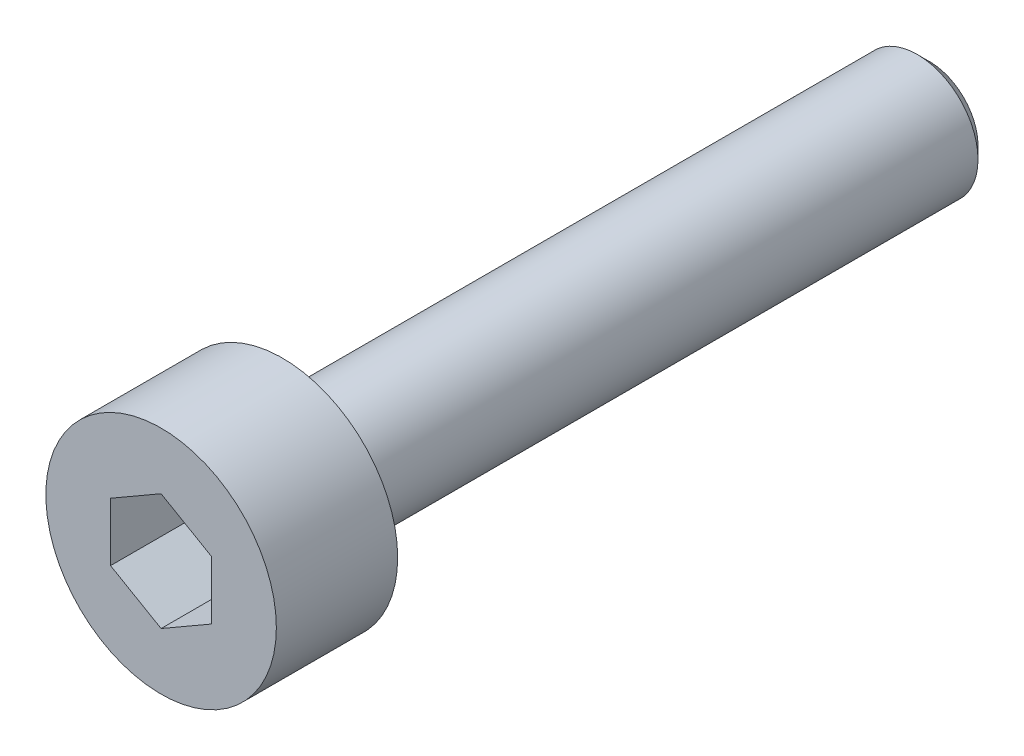
ISO-10303-21;
HEADER;
FILE_DESCRIPTION(('STEP AP214'),'2;1');
FILE_NAME('part.step','',(''),(''),'','','');
FILE_SCHEMA(('AUTOMOTIVE_DESIGN { 1 0 10303 214 1 1 1 1 }'));
ENDSEC;
DATA;
#1=APPLICATION_CONTEXT('core data for automotive mechanical design processes');
#2=APPLICATION_PROTOCOL_DEFINITION('international standard','automotive_design',2000,#1);
#3=PRODUCT_CONTEXT('',#1,'mechanical');
#4=PRODUCT('Part','Part','',(#3));
#5=PRODUCT_RELATED_PRODUCT_CATEGORY('part','',(#4));
#6=PRODUCT_DEFINITION_FORMATION('','',#4);
#7=PRODUCT_DEFINITION_CONTEXT('part definition',#1,'design');
#8=PRODUCT_DEFINITION('design','',#6,#7);
#9=PRODUCT_DEFINITION_SHAPE('','',#8);
#10=(LENGTH_UNIT() NAMED_UNIT(*) SI_UNIT(.MILLI.,.METRE.));
#11=(NAMED_UNIT(*) PLANE_ANGLE_UNIT() SI_UNIT($,.RADIAN.));
#12=(NAMED_UNIT(*) SI_UNIT($,.STERADIAN.) SOLID_ANGLE_UNIT());
#13=UNCERTAINTY_MEASURE_WITH_UNIT(LENGTH_MEASURE(1.E-05),#10,'distance_accuracy_value','');
#14=(GEOMETRIC_REPRESENTATION_CONTEXT(3) GLOBAL_UNCERTAINTY_ASSIGNED_CONTEXT((#13)) GLOBAL_UNIT_ASSIGNED_CONTEXT((#10,
#11,#12)) REPRESENTATION_CONTEXT('',''));
#15=CARTESIAN_POINT('',(0.,0.,0.));
#16=DIRECTION('',(0.,0.,1.));
#17=DIRECTION('',(1.,0.,0.));
#18=AXIS2_PLACEMENT_3D('',#15,#16,#17);
#19=CARTESIAN_POINT('',(0.,0.,0.));
#20=DIRECTION('',(0.,0.,1.));
#21=DIRECTION('',(1.,0.,0.));
#22=AXIS2_PLACEMENT_3D('',#19,#20,#21);
#23=PLANE('',#22);
#24=CARTESIAN_POINT('',(0.,0.,0.));
#25=DIRECTION('',(0.,0.,1.));
#26=DIRECTION('',(1.,0.,0.));
#27=AXIS2_PLACEMENT_3D('',#24,#25,#26);
#28=CIRCLE('',#27,2.85);
#29=CARTESIAN_POINT('',(2.85,0.,0.));
#30=VERTEX_POINT('',#29);
#31=EDGE_CURVE('E136',#30,#30,#28,.T.);
#32=ORIENTED_EDGE('',*,*,#31,.F.);
#33=EDGE_LOOP('',(#32));
#34=FACE_BOUND('',#33,.T.);
#35=CARTESIAN_POINT('',(0.,0.,0.));
#36=DIRECTION('',(0.,0.,1.));
#37=DIRECTION('',(1.,0.,0.));
#38=AXIS2_PLACEMENT_3D('',#35,#36,#37);
#39=CIRCLE('',#38,1.5);
#40=CARTESIAN_POINT('',(1.5,0.,0.));
#41=VERTEX_POINT('',#40);
#42=EDGE_CURVE('E145',#41,#41,#39,.F.);
#43=ORIENTED_EDGE('',*,*,#42,.F.);
#44=EDGE_LOOP('',(#43));
#45=FACE_BOUND('',#44,.T.);
#46=ADVANCED_FACE('F34',(#34,#45),#23,.F.);
#47=CARTESIAN_POINT('',(0.,0.,3.));
#48=DIRECTION('',(0.,0.,-1.));
#49=DIRECTION('',(-1.,0.,0.));
#50=AXIS2_PLACEMENT_3D('',#47,#48,#49);
#51=CYLINDRICAL_SURFACE('',#50,2.85);
#52=CARTESIAN_POINT('',(0.,0.,3.));
#53=DIRECTION('',(0.,0.,1.));
#54=DIRECTION('',(1.,0.,0.));
#55=AXIS2_PLACEMENT_3D('',#52,#53,#54);
#56=CIRCLE('',#55,2.85);
#57=CARTESIAN_POINT('',(2.85,0.,3.));
#58=VERTEX_POINT('',#57);
#59=EDGE_CURVE('E142',#58,#58,#56,.T.);
#60=ORIENTED_EDGE('',*,*,#59,.F.);
#61=EDGE_LOOP('',(#60));
#62=FACE_BOUND('',#61,.T.);
#63=ORIENTED_EDGE('',*,*,#31,.T.);
#64=EDGE_LOOP('',(#63));
#65=FACE_BOUND('',#64,.T.);
#66=ADVANCED_FACE('F167',(#62,#65),#51,.T.);
#67=CARTESIAN_POINT('',(0.,0.,3.));
#68=DIRECTION('',(0.,0.,1.));
#69=DIRECTION('',(1.,0.,0.));
#70=AXIS2_PLACEMENT_3D('',#67,#68,#69);
#71=PLANE('',#70);
#72=DIRECTION('',(-0.866025403784439,0.5,0.));
#73=VECTOR('',#72,1.);
#74=CARTESIAN_POINT('',(1.25,0.721687836487032,3.));
#75=LINE('',#74,#73);
#76=CARTESIAN_POINT('',(1.25,0.721687836487032,3.));
#77=VERTEX_POINT('',#76);
#78=CARTESIAN_POINT('',(0.,1.44337567297406,3.));
#79=VERTEX_POINT('',#78);
#80=EDGE_CURVE('E49',#77,#79,#75,.T.);
#81=ORIENTED_EDGE('',*,*,#80,.F.);
#82=DIRECTION('',(0.,1.,0.));
#83=VECTOR('',#82,1.);
#84=CARTESIAN_POINT('',(1.25,-0.721687836487032,3.));
#85=LINE('',#84,#83);
#86=CARTESIAN_POINT('',(1.25,-0.721687836487032,3.));
#87=VERTEX_POINT('',#86);
#88=EDGE_CURVE('E132',#87,#77,#85,.T.);
#89=ORIENTED_EDGE('',*,*,#88,.F.);
#90=DIRECTION('',(0.866025403784439,0.5,0.));
#91=VECTOR('',#90,1.);
#92=CARTESIAN_POINT('',(0.,-1.44337567297406,3.));
#93=LINE('',#92,#91);
#94=CARTESIAN_POINT('',(0.,-1.44337567297406,3.));
#95=VERTEX_POINT('',#94);
#96=EDGE_CURVE('E130',#95,#87,#93,.T.);
#97=ORIENTED_EDGE('',*,*,#96,.F.);
#98=DIRECTION('',(0.866025403784439,-0.5,0.));
#99=VECTOR('',#98,1.);
#100=CARTESIAN_POINT('',(-1.25,-0.721687836487033,3.));
#101=LINE('',#100,#99);
#102=CARTESIAN_POINT('',(-1.25,-0.721687836487033,3.));
#103=VERTEX_POINT('',#102);
#104=EDGE_CURVE('E97',#103,#95,#101,.T.);
#105=ORIENTED_EDGE('',*,*,#104,.F.);
#106=DIRECTION('',(0.,-1.,0.));
#107=VECTOR('',#106,1.);
#108=CARTESIAN_POINT('',(-1.25,0.721687836487032,3.));
#109=LINE('',#108,#107);
#110=CARTESIAN_POINT('',(-1.25,0.721687836487032,3.));
#111=VERTEX_POINT('',#110);
#112=EDGE_CURVE('E126',#111,#103,#109,.T.);
#113=ORIENTED_EDGE('',*,*,#112,.F.);
#114=DIRECTION('',(-0.866025403784439,-0.5,0.));
#115=VECTOR('',#114,1.);
#116=CARTESIAN_POINT('',(0.,1.44337567297406,3.));
#117=LINE('',#116,#115);
#118=EDGE_CURVE('E123',#79,#111,#117,.T.);
#119=ORIENTED_EDGE('',*,*,#118,.F.);
#120=EDGE_LOOP('',(#81,#89,#97,#105,#113,#119));
#121=FACE_BOUND('',#120,.T.);
#122=ORIENTED_EDGE('',*,*,#59,.T.);
#123=EDGE_LOOP('',(#122));
#124=FACE_BOUND('',#123,.T.);
#125=ADVANCED_FACE('F173',(#121,#124),#71,.T.);
#126=CARTESIAN_POINT('',(0.,0.,-16.));
#127=DIRECTION('',(0.,0.,1.));
#128=DIRECTION('',(1.,0.,0.));
#129=AXIS2_PLACEMENT_3D('',#126,#127,#128);
#130=CYLINDRICAL_SURFACE('',#129,1.5);
#131=CARTESIAN_POINT('',(0.,0.,-15.7));
#132=DIRECTION('',(0.,0.,-1.));
#133=DIRECTION('',(-1.,0.,0.));
#134=AXIS2_PLACEMENT_3D('',#131,#132,#133);
#135=CIRCLE('',#134,1.5);
#136=CARTESIAN_POINT('',(-1.5,0.,-15.7));
#137=VERTEX_POINT('',#136);
#138=EDGE_CURVE('E11',#137,#137,#135,.F.);
#139=ORIENTED_EDGE('',*,*,#138,.T.);
#140=EDGE_LOOP('',(#139));
#141=FACE_BOUND('',#140,.T.);
#142=ORIENTED_EDGE('',*,*,#42,.T.);
#143=EDGE_LOOP('',(#142));
#144=FACE_BOUND('',#143,.T.);
#145=ADVANCED_FACE('F163',(#141,#144),#130,.T.);
#146=CARTESIAN_POINT('',(0.,0.,-16.));
#147=DIRECTION('',(0.,0.,-1.));
#148=DIRECTION('',(-1.,0.,0.));
#149=AXIS2_PLACEMENT_3D('',#146,#147,#148);
#150=PLANE('',#149);
#151=CARTESIAN_POINT('',(0.,0.,-16.));
#152=DIRECTION('',(0.,0.,-1.));
#153=DIRECTION('',(-1.,0.,0.));
#154=AXIS2_PLACEMENT_3D('',#151,#152,#153);
#155=CIRCLE('',#154,1.2);
#156=CARTESIAN_POINT('',(-1.2,0.,-16.));
#157=VERTEX_POINT('',#156);
#158=EDGE_CURVE('E42',#157,#157,#155,.T.);
#159=ORIENTED_EDGE('',*,*,#158,.T.);
#160=EDGE_LOOP('',(#159));
#161=FACE_BOUND('',#160,.T.);
#162=ADVANCED_FACE('F152',(#161),#150,.T.);
#163=CARTESIAN_POINT('',(0.,0.,-16.));
#164=DIRECTION('',(0.,0.,1.));
#165=DIRECTION('',(1.,0.,0.));
#166=AXIS2_PLACEMENT_3D('',#163,#164,#165);
#167=CONICAL_SURFACE('',#166,1.2,0.785398163397455);
#168=ORIENTED_EDGE('',*,*,#138,.F.);
#169=EDGE_LOOP('',(#168));
#170=FACE_BOUND('',#169,.T.);
#171=ORIENTED_EDGE('',*,*,#158,.F.);
#172=EDGE_LOOP('',(#171));
#173=FACE_BOUND('',#172,.T.);
#174=ADVANCED_FACE('F36',(#170,#173),#167,.T.);
#175=CARTESIAN_POINT('',(1.25,0.721687836487032,1.));
#176=DIRECTION('',(0.5,0.866025403784439,0.));
#177=DIRECTION('',(-0.866025403784439,0.5,0.));
#178=AXIS2_PLACEMENT_3D('',#175,#176,#177);
#179=PLANE('',#178);
#180=ORIENTED_EDGE('',*,*,#80,.T.);
#181=DIRECTION('',(0.,0.,1.));
#182=VECTOR('',#181,1.);
#183=CARTESIAN_POINT('',(0.,1.44337567297406,1.));
#184=LINE('',#183,#182);
#185=CARTESIAN_POINT('',(0.,1.44337567297406,1.));
#186=VERTEX_POINT('',#185);
#187=EDGE_CURVE('E79',#186,#79,#184,.T.);
#188=ORIENTED_EDGE('',*,*,#187,.F.);
#189=DIRECTION('',(-0.866025403784439,0.5,0.));
#190=VECTOR('',#189,1.);
#191=CARTESIAN_POINT('',(1.25,0.721687836487032,1.));
#192=LINE('',#191,#190);
#193=CARTESIAN_POINT('',(1.25,0.721687836487032,1.));
#194=VERTEX_POINT('',#193);
#195=EDGE_CURVE('E134',#194,#186,#192,.T.);
#196=ORIENTED_EDGE('',*,*,#195,.F.);
#197=DIRECTION('',(0.,0.,1.));
#198=VECTOR('',#197,1.);
#199=CARTESIAN_POINT('',(1.25,0.721687836487032,1.));
#200=LINE('',#199,#198);
#201=EDGE_CURVE('E57',#194,#77,#200,.T.);
#202=ORIENTED_EDGE('',*,*,#201,.T.);
#203=EDGE_LOOP('',(#180,#188,#196,#202));
#204=FACE_BOUND('',#203,.T.);
#205=ADVANCED_FACE('F155',(#204),#179,.F.);
#206=CARTESIAN_POINT('',(1.25,-0.721687836487032,1.));
#207=DIRECTION('',(1.,0.,0.));
#208=DIRECTION('',(0.,1.,0.));
#209=AXIS2_PLACEMENT_3D('',#206,#207,#208);
#210=PLANE('',#209);
#211=ORIENTED_EDGE('',*,*,#88,.T.);
#212=ORIENTED_EDGE('',*,*,#201,.F.);
#213=DIRECTION('',(0.,1.,0.));
#214=VECTOR('',#213,1.);
#215=CARTESIAN_POINT('',(1.25,-0.721687836487032,1.));
#216=LINE('',#215,#214);
#217=CARTESIAN_POINT('',(1.25,-0.721687836487032,1.));
#218=VERTEX_POINT('',#217);
#219=EDGE_CURVE('E109',#218,#194,#216,.T.);
#220=ORIENTED_EDGE('',*,*,#219,.F.);
#221=DIRECTION('',(0.,0.,1.));
#222=VECTOR('',#221,1.);
#223=CARTESIAN_POINT('',(1.25,-0.721687836487032,1.));
#224=LINE('',#223,#222);
#225=EDGE_CURVE('E101',#218,#87,#224,.T.);
#226=ORIENTED_EDGE('',*,*,#225,.T.);
#227=EDGE_LOOP('',(#211,#212,#220,#226));
#228=FACE_BOUND('',#227,.T.);
#229=ADVANCED_FACE('F161',(#228),#210,.F.);
#230=CARTESIAN_POINT('',(0.,-1.44337567297406,1.));
#231=DIRECTION('',(0.5,-0.866025403784439,0.));
#232=DIRECTION('',(0.866025403784439,0.5,0.));
#233=AXIS2_PLACEMENT_3D('',#230,#231,#232);
#234=PLANE('',#233);
#235=ORIENTED_EDGE('',*,*,#96,.T.);
#236=ORIENTED_EDGE('',*,*,#225,.F.);
#237=DIRECTION('',(0.866025403784439,0.5,0.));
#238=VECTOR('',#237,1.);
#239=CARTESIAN_POINT('',(0.,-1.44337567297406,1.));
#240=LINE('',#239,#238);
#241=CARTESIAN_POINT('',(0.,-1.44337567297406,1.));
#242=VERTEX_POINT('',#241);
#243=EDGE_CURVE('E105',#242,#218,#240,.T.);
#244=ORIENTED_EDGE('',*,*,#243,.F.);
#245=DIRECTION('',(0.,0.,1.));
#246=VECTOR('',#245,1.);
#247=CARTESIAN_POINT('',(0.,-1.44337567297406,1.));
#248=LINE('',#247,#246);
#249=EDGE_CURVE('E90',#242,#95,#248,.T.);
#250=ORIENTED_EDGE('',*,*,#249,.T.);
#251=EDGE_LOOP('',(#235,#236,#244,#250));
#252=FACE_BOUND('',#251,.T.);
#253=ADVANCED_FACE('F106',(#252),#234,.F.);
#254=CARTESIAN_POINT('',(-1.25,-0.721687836487033,1.));
#255=DIRECTION('',(-0.5,-0.866025403784439,0.));
#256=DIRECTION('',(0.866025403784439,-0.5,0.));
#257=AXIS2_PLACEMENT_3D('',#254,#255,#256);
#258=PLANE('',#257);
#259=ORIENTED_EDGE('',*,*,#104,.T.);
#260=ORIENTED_EDGE('',*,*,#249,.F.);
#261=DIRECTION('',(0.866025403784439,-0.5,0.));
#262=VECTOR('',#261,1.);
#263=CARTESIAN_POINT('',(-1.25,-0.721687836487033,1.));
#264=LINE('',#263,#262);
#265=CARTESIAN_POINT('',(-1.25,-0.721687836487033,1.));
#266=VERTEX_POINT('',#265);
#267=EDGE_CURVE('E94',#266,#242,#264,.T.);
#268=ORIENTED_EDGE('',*,*,#267,.F.);
#269=DIRECTION('',(0.,0.,1.));
#270=VECTOR('',#269,1.);
#271=CARTESIAN_POINT('',(-1.25,-0.721687836487033,1.));
#272=LINE('',#271,#270);
#273=EDGE_CURVE('E102',#266,#103,#272,.T.);
#274=ORIENTED_EDGE('',*,*,#273,.T.);
#275=EDGE_LOOP('',(#259,#260,#268,#274));
#276=FACE_BOUND('',#275,.T.);
#277=ADVANCED_FACE('F92',(#276),#258,.F.);
#278=CARTESIAN_POINT('',(-1.25,0.721687836487032,1.));
#279=DIRECTION('',(-1.,0.,0.));
#280=DIRECTION('',(0.,0.,1.));
#281=AXIS2_PLACEMENT_3D('',#278,#279,#280);
#282=PLANE('',#281);
#283=ORIENTED_EDGE('',*,*,#112,.T.);
#284=ORIENTED_EDGE('',*,*,#273,.F.);
#285=DIRECTION('',(0.,-1.,0.));
#286=VECTOR('',#285,1.);
#287=CARTESIAN_POINT('',(-1.25,0.721687836487032,1.));
#288=LINE('',#287,#286);
#289=CARTESIAN_POINT('',(-1.25,0.721687836487032,1.));
#290=VERTEX_POINT('',#289);
#291=EDGE_CURVE('E115',#290,#266,#288,.T.);
#292=ORIENTED_EDGE('',*,*,#291,.F.);
#293=DIRECTION('',(0.,0.,1.));
#294=VECTOR('',#293,1.);
#295=CARTESIAN_POINT('',(-1.25,0.721687836487032,1.));
#296=LINE('',#295,#294);
#297=EDGE_CURVE('E139',#290,#111,#296,.T.);
#298=ORIENTED_EDGE('',*,*,#297,.T.);
#299=EDGE_LOOP('',(#283,#284,#292,#298));
#300=FACE_BOUND('',#299,.T.);
#301=ADVANCED_FACE('F187',(#300),#282,.F.);
#302=CARTESIAN_POINT('',(0.,1.44337567297406,1.));
#303=DIRECTION('',(-0.5,0.866025403784439,0.));
#304=DIRECTION('',(-0.866025403784439,-0.5,0.));
#305=AXIS2_PLACEMENT_3D('',#302,#303,#304);
#306=PLANE('',#305);
#307=ORIENTED_EDGE('',*,*,#118,.T.);
#308=ORIENTED_EDGE('',*,*,#297,.F.);
#309=DIRECTION('',(-0.866025403784439,-0.5,0.));
#310=VECTOR('',#309,1.);
#311=CARTESIAN_POINT('',(0.,1.44337567297406,1.));
#312=LINE('',#311,#310);
#313=EDGE_CURVE('E117',#186,#290,#312,.T.);
#314=ORIENTED_EDGE('',*,*,#313,.F.);
#315=ORIENTED_EDGE('',*,*,#187,.T.);
#316=EDGE_LOOP('',(#307,#308,#314,#315));
#317=FACE_BOUND('',#316,.T.);
#318=ADVANCED_FACE('F184',(#317),#306,.F.);
#319=CARTESIAN_POINT('',(0.,0.,1.));
#320=DIRECTION('',(0.,0.,1.));
#321=DIRECTION('',(1.,0.,0.));
#322=AXIS2_PLACEMENT_3D('',#319,#320,#321);
#323=PLANE('',#322);
#324=ORIENTED_EDGE('',*,*,#195,.T.);
#325=ORIENTED_EDGE('',*,*,#313,.T.);
#326=ORIENTED_EDGE('',*,*,#291,.T.);
#327=ORIENTED_EDGE('',*,*,#267,.T.);
#328=ORIENTED_EDGE('',*,*,#243,.T.);
#329=ORIENTED_EDGE('',*,*,#219,.T.);
#330=EDGE_LOOP('',(#324,#325,#326,#327,#328,#329));
#331=FACE_BOUND('',#330,.T.);
#332=ADVANCED_FACE('F112',(#331),#323,.T.);
#333=CLOSED_SHELL('',(#46,#66,#125,#145,#162,#174,#205,#229,#253,#277,#301,#318,#332));
#334=MANIFOLD_SOLID_BREP('B2',#333);
#335=ADVANCED_BREP_SHAPE_REPRESENTATION('',(#18,#334),#14);
#336=SHAPE_DEFINITION_REPRESENTATION(#9,#335);
ENDSEC;
END-ISO-10303-21;
